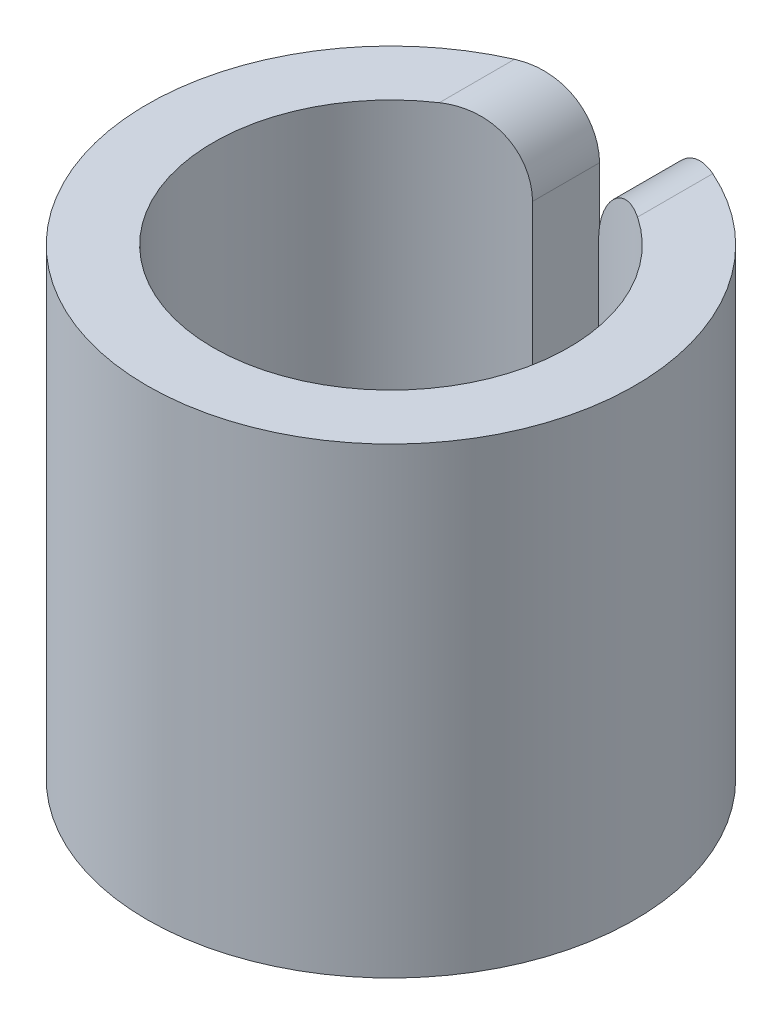
ISO-10303-21;
HEADER;
FILE_DESCRIPTION(('STEP AP214'),'2;1');
FILE_NAME('part.step','',(''),(''),'','','');
FILE_SCHEMA(('AUTOMOTIVE_DESIGN { 1 0 10303 214 1 1 1 1 }'));
ENDSEC;
DATA;
#1=APPLICATION_CONTEXT('core data for automotive mechanical design processes');
#2=APPLICATION_PROTOCOL_DEFINITION('international standard','automotive_design',2000,#1);
#3=PRODUCT_CONTEXT('',#1,'mechanical');
#4=PRODUCT('Part','Part','',(#3));
#5=PRODUCT_RELATED_PRODUCT_CATEGORY('part','',(#4));
#6=PRODUCT_DEFINITION_FORMATION('','',#4);
#7=PRODUCT_DEFINITION_CONTEXT('part definition',#1,'design');
#8=PRODUCT_DEFINITION('design','',#6,#7);
#9=PRODUCT_DEFINITION_SHAPE('','',#8);
#10=(LENGTH_UNIT() NAMED_UNIT(*) SI_UNIT(.MILLI.,.METRE.));
#11=(NAMED_UNIT(*) PLANE_ANGLE_UNIT() SI_UNIT($,.RADIAN.));
#12=(NAMED_UNIT(*) SI_UNIT($,.STERADIAN.) SOLID_ANGLE_UNIT());
#13=UNCERTAINTY_MEASURE_WITH_UNIT(LENGTH_MEASURE(1.E-05),#10,'distance_accuracy_value','');
#14=(GEOMETRIC_REPRESENTATION_CONTEXT(3) GLOBAL_UNCERTAINTY_ASSIGNED_CONTEXT((#13)) GLOBAL_UNIT_ASSIGNED_CONTEXT((#10,
#11,#12)) REPRESENTATION_CONTEXT('',''));
#15=CARTESIAN_POINT('',(0.,0.,0.));
#16=DIRECTION('',(0.,0.,1.));
#17=DIRECTION('',(1.,0.,0.));
#18=AXIS2_PLACEMENT_3D('',#15,#16,#17);
#19=CARTESIAN_POINT('',(0.,3.5,0.));
#20=DIRECTION('',(0.,1.,0.));
#21=DIRECTION('',(0.,0.,1.));
#22=AXIS2_PLACEMENT_3D('',#19,#20,#21);
#23=PLANE('',#22);
#24=CARTESIAN_POINT('',(0.,3.5,0.));
#25=DIRECTION('',(0.,1.,0.));
#26=DIRECTION('',(1.,0.,0.));
#27=AXIS2_PLACEMENT_3D('',#24,#25,#26);
#28=CIRCLE('',#27,3.69);
#29=CARTESIAN_POINT('',(-1.50000000000031,3.5,-3.37136470883811));
#30=VERTEX_POINT('',#29);
#31=CARTESIAN_POINT('',(1.5000000000003,3.5,-3.37136470883811));
#32=VERTEX_POINT('',#31);
#33=EDGE_CURVE('E228',#30,#32,#28,.T.);
#34=ORIENTED_EDGE('',*,*,#33,.T.);
#35=DIRECTION('',(0.,0.,-1.));
#36=VECTOR('',#35,1.);
#37=CARTESIAN_POINT('',(1.5000000000003,3.5,-2.64312315263586));
#38=LINE('',#37,#36);
#39=CARTESIAN_POINT('',(1.5000000000003,3.5,-2.23295767984955));
#40=VERTEX_POINT('',#39);
#41=EDGE_CURVE('E138',#32,#40,#38,.F.);
#42=ORIENTED_EDGE('',*,*,#41,.T.);
#43=CARTESIAN_POINT('',(0.,3.5,0.));
#44=DIRECTION('',(0.,1.,0.));
#45=DIRECTION('',(0.,0.,1.));
#46=AXIS2_PLACEMENT_3D('',#43,#44,#45);
#47=CIRCLE('',#46,2.69);
#48=CARTESIAN_POINT('',(-1.50000000000031,3.5,-2.23295767984955));
#49=VERTEX_POINT('',#48);
#50=EDGE_CURVE('E232',#49,#40,#47,.T.);
#51=ORIENTED_EDGE('',*,*,#50,.F.);
#52=DIRECTION('',(0.,0.,1.));
#53=VECTOR('',#52,1.);
#54=CARTESIAN_POINT('',(-1.50000000000031,3.5,-3.65596772414633));
#55=LINE('',#54,#53);
#56=EDGE_CURVE('E144',#49,#30,#55,.F.);
#57=ORIENTED_EDGE('',*,*,#56,.T.);
#58=EDGE_LOOP('',(#34,#42,#51,#57));
#59=FACE_BOUND('',#58,.T.);
#60=ADVANCED_FACE('F43',(#59),#23,.T.);
#61=CARTESIAN_POINT('',(0.,-3.5,0.));
#62=DIRECTION('',(0.,1.,0.));
#63=DIRECTION('',(0.,0.,1.));
#64=AXIS2_PLACEMENT_3D('',#61,#62,#63);
#65=PLANE('',#64);
#66=CARTESIAN_POINT('',(0.,-3.5,0.));
#67=DIRECTION('',(0.,1.,0.));
#68=DIRECTION('',(1.,0.,0.));
#69=AXIS2_PLACEMENT_3D('',#66,#67,#68);
#70=CIRCLE('',#69,3.69);
#71=CARTESIAN_POINT('',(-1.50000000000031,-3.5,-3.37136470883811));
#72=VERTEX_POINT('',#71);
#73=CARTESIAN_POINT('',(1.5000000000003,-3.5,-3.37136470883811));
#74=VERTEX_POINT('',#73);
#75=EDGE_CURVE('E229',#72,#74,#70,.T.);
#76=ORIENTED_EDGE('',*,*,#75,.F.);
#77=DIRECTION('',(0.,0.,1.));
#78=VECTOR('',#77,1.);
#79=CARTESIAN_POINT('',(-1.50000000000031,-3.5,0.));
#80=LINE('',#79,#78);
#81=CARTESIAN_POINT('',(-1.50000000000031,-3.5,-2.23295767984955));
#82=VERTEX_POINT('',#81);
#83=EDGE_CURVE('E12',#72,#82,#80,.T.);
#84=ORIENTED_EDGE('',*,*,#83,.T.);
#85=CARTESIAN_POINT('',(0.,-3.5,0.));
#86=DIRECTION('',(0.,1.,0.));
#87=DIRECTION('',(0.,0.,1.));
#88=AXIS2_PLACEMENT_3D('',#85,#86,#87);
#89=CIRCLE('',#88,2.69);
#90=CARTESIAN_POINT('',(1.5000000000003,-3.5,-2.23295767984955));
#91=VERTEX_POINT('',#90);
#92=EDGE_CURVE('E236',#82,#91,#89,.T.);
#93=ORIENTED_EDGE('',*,*,#92,.T.);
#94=DIRECTION('',(0.,0.,-1.));
#95=VECTOR('',#94,1.);
#96=CARTESIAN_POINT('',(1.50000000000031,-3.5,0.));
#97=LINE('',#96,#95);
#98=EDGE_CURVE('E53',#91,#74,#97,.T.);
#99=ORIENTED_EDGE('',*,*,#98,.T.);
#100=EDGE_LOOP('',(#76,#84,#93,#99));
#101=FACE_BOUND('',#100,.T.);
#102=ADVANCED_FACE('F212',(#101),#65,.F.);
#103=CARTESIAN_POINT('',(0.,3.5,0.));
#104=DIRECTION('',(0.,-1.,0.));
#105=DIRECTION('',(0.,0.,-1.));
#106=AXIS2_PLACEMENT_3D('',#103,#104,#105);
#107=CYLINDRICAL_SURFACE('',#106,3.69);
#108=DIRECTION('',(0.,-1.,0.));
#109=VECTOR('',#108,1.);
#110=CARTESIAN_POINT('',(0.500000000000304,3.5,-3.65596772414633));
#111=LINE('',#110,#109);
#112=CARTESIAN_POINT('',(0.500000000000304,-2.5,-3.65596772414633));
#113=VERTEX_POINT('',#112);
#114=CARTESIAN_POINT('',(0.500000000000304,2.5,-3.65596772414633));
#115=VERTEX_POINT('',#114);
#116=EDGE_CURVE('E120',#113,#115,#111,.F.);
#117=ORIENTED_EDGE('',*,*,#116,.T.);
#118=CARTESIAN_POINT('',(0.500000000000304,2.5,-3.65596772414633));
#119=CARTESIAN_POINT('',(0.500000082817128,2.52781308003016,-3.65596589444756));
#120=CARTESIAN_POINT('',(0.501161105023619,2.55561289754367,-3.65580913444034));
#121=CARTESIAN_POINT('',(0.505792187211567,2.6110148931079,-3.65517199456636));
#122=CARTESIAN_POINT('',(0.50926217660817,2.63861707717418,-3.65469162459231));
#123=CARTESIAN_POINT('',(0.523102806023595,2.72079211858252,-3.65274636491329));
#124=CARTESIAN_POINT('',(0.536904193141292,2.77481659287134,-3.65077739985674));
#125=CARTESIAN_POINT('',(0.573247241827748,2.87976144457652,-3.64524643417263));
#126=CARTESIAN_POINT('',(0.595794067371662,2.93067996740592,-3.64168349214823));
#127=CARTESIAN_POINT('',(0.648916993247099,3.02794443270229,-3.63259271768315));
#128=CARTESIAN_POINT('',(0.679491276005795,3.07429140699323,-3.62706532993124));
#129=CARTESIAN_POINT('',(0.747538941507797,3.16092764397699,-3.61365181736284));
#130=CARTESIAN_POINT('',(0.784985584494407,3.20123932206504,-3.6057747630603));
#131=CARTESIAN_POINT('',(0.86558425601745,3.27491725667402,-3.58727877515535));
#132=CARTESIAN_POINT('',(0.908735294516107,3.30828471583168,-3.5766603170387));
#133=CARTESIAN_POINT('',(0.999193522604081,3.36723924266644,-3.55244956037333));
#134=CARTESIAN_POINT('',(1.04649411359834,3.39283838441752,-3.53886193385552));
#135=CARTESIAN_POINT('',(1.14377324755107,3.43591339166262,-3.50862903091158));
#136=CARTESIAN_POINT('',(1.1937533511762,3.45338446440442,-3.49198195851895));
#137=CARTESIAN_POINT('',(1.28669550289056,3.47797157474241,-3.45869061170086));
#138=CARTESIAN_POINT('',(1.3294987111058,3.48629834377232,-3.44247338148098));
#139=CARTESIAN_POINT('',(1.41499714517253,3.4973139193632,-3.40823040303336));
#140=CARTESIAN_POINT('',(1.45769239463773,3.50001554219229,-3.39020886421097));
#141=CARTESIAN_POINT('',(1.5000000000003,3.5,-3.37136470883811));
#142=B_SPLINE_CURVE_WITH_KNOTS('',3,(#118,#119,#120,#121,#122,#123,#124,#125,#126,#127,#128,
#129,#130,#131,#132,#133,#134,#135,#136,#137,#138,#139,#140,#141),.UNSPECIFIED.,.F.,.F.,(4,2,2,
2,2,2,2,2,2,2,2,4),(0.,0.0833881928345898,0.166773836619071,0.33329890321556,0.499922448993869,
0.666508300438434,0.832459217659524,0.998381370658126,1.16404429891574,1.32980478763568,
1.46900232215449,1.60788236202148),.UNSPECIFIED.);
#143=EDGE_CURVE('E199',#115,#32,#142,.T.);
#144=ORIENTED_EDGE('',*,*,#143,.T.);
#145=ORIENTED_EDGE('',*,*,#33,.F.);
#146=CARTESIAN_POINT('',(-1.50000000000031,3.5,-3.37136470883811));
#147=CARTESIAN_POINT('',(-1.47283124298569,3.49999911402014,-3.38345442984184));
#148=CARTESIAN_POINT('',(-1.44552337566981,3.49889177376586,-3.39520865002755));
#149=CARTESIAN_POINT('',(-1.39078220506359,3.49439800416099,-3.41799695761536));
#150=CARTESIAN_POINT('',(-1.36334885324912,3.49101060313515,-3.42903073579233));
#151=CARTESIAN_POINT('',(-1.28108333169826,3.47732339670899,-3.4609787511372));
#152=CARTESIAN_POINT('',(-1.22632751721839,3.46349838659932,-3.48072111622429));
#153=CARTESIAN_POINT('',(-1.11880038559413,3.42624830983785,-3.51676237348628));
#154=CARTESIAN_POINT('',(-1.06603529477733,3.40279547467992,-3.53305109688307));
#155=CARTESIAN_POINT('',(-0.964681452839087,3.34663014332049,-3.56205915549299));
#156=CARTESIAN_POINT('',(-0.91608709375197,3.31393034314585,-3.57478333744522));
#157=CARTESIAN_POINT('',(-0.827434063685409,3.24211299988178,-3.59630721396851));
#158=CARTESIAN_POINT('',(-0.787054004133002,3.20344399168274,-3.60528341577583));
#159=CARTESIAN_POINT('',(-0.713091469623131,3.11959659706418,-3.62063960903582));
#160=CARTESIAN_POINT('',(-0.679511640998017,3.0744156881796,-3.62701859074379));
#161=CARTESIAN_POINT('',(-0.620941115192489,2.97988048549831,-3.63749948407966));
#162=CARTESIAN_POINT('',(-0.595786449806398,2.93063241244919,-3.64164595484003));
#163=CARTESIAN_POINT('',(-0.553917903150092,2.82858167000932,-3.64824978499721));
#164=CARTESIAN_POINT('',(-0.537198866652182,2.77578119399971,-3.65070817635475));
#165=CARTESIAN_POINT('',(-0.516660421431358,2.68557832345602,-3.6536601325258));
#166=CARTESIAN_POINT('',(-0.510417633291857,2.64872065017259,-3.65453204876113));
#167=CARTESIAN_POINT('',(-0.502087280502385,2.57458021975313,-3.65568230067327));
#168=CARTESIAN_POINT('',(-0.499994096884805,2.53729810629023,-3.65596143906539));
#169=CARTESIAN_POINT('',(-0.500000000000306,2.5,-3.65596772414633));
#170=B_SPLINE_CURVE_WITH_KNOTS('',3,(#146,#147,#148,#149,#150,#151,#152,#153,#154,#155,#156,
#157,#158,#159,#160,#161,#162,#163,#164,#165,#166,#167,#168,#169),.UNSPECIFIED.,.F.,.F.,(4,2,2,
2,2,2,2,2,2,2,2,4),(0.,0.0891673504576794,0.178372724729981,0.356919087446533,0.535984071296006,
0.714804383854775,0.883849602199933,1.05296047916786,1.21855755873119,1.38405331475116,
1.49600844207335,1.60781186744674),.UNSPECIFIED.);
#171=CARTESIAN_POINT('',(-0.500000000000306,2.5,-3.65596772414633));
#172=VERTEX_POINT('',#171);
#173=EDGE_CURVE('E191',#30,#172,#170,.T.);
#174=ORIENTED_EDGE('',*,*,#173,.T.);
#175=DIRECTION('',(0.,-1.,0.));
#176=VECTOR('',#175,1.);
#177=CARTESIAN_POINT('',(-0.500000000000306,3.5,-3.65596772414633));
#178=LINE('',#177,#176);
#179=CARTESIAN_POINT('',(-0.500000000000306,-2.5,-3.65596772414633));
#180=VERTEX_POINT('',#179);
#181=EDGE_CURVE('E243',#172,#180,#178,.T.);
#182=ORIENTED_EDGE('',*,*,#181,.T.);
#183=CARTESIAN_POINT('',(-0.500000000000306,-2.5,-3.65596772414633));
#184=CARTESIAN_POINT('',(-0.50000008281713,-2.52781308003016,-3.65596589444755));
#185=CARTESIAN_POINT('',(-0.501161105023621,-2.55561289754367,-3.65580913444034));
#186=CARTESIAN_POINT('',(-0.505792187211569,-2.6110148931079,-3.65517199456636));
#187=CARTESIAN_POINT('',(-0.509262176608172,-2.63861707717418,-3.6546916245923));
#188=CARTESIAN_POINT('',(-0.523102806023597,-2.72079211858252,-3.65274636491329));
#189=CARTESIAN_POINT('',(-0.536904193141294,-2.77481659287134,-3.65077739985674));
#190=CARTESIAN_POINT('',(-0.57324724182775,-2.87976144457652,-3.64524643417262));
#191=CARTESIAN_POINT('',(-0.595794067371664,-2.93067996740592,-3.64168349214823));
#192=CARTESIAN_POINT('',(-0.648916993247101,-3.02794443270229,-3.63259271768315));
#193=CARTESIAN_POINT('',(-0.679491276005797,-3.07429140699323,-3.62706532993124));
#194=CARTESIAN_POINT('',(-0.747538941507798,-3.16092764397699,-3.61365181736284));
#195=CARTESIAN_POINT('',(-0.78498558449441,-3.20123932206504,-3.6057747630603));
#196=CARTESIAN_POINT('',(-0.865584256017452,-3.27491725667402,-3.58727877515535));
#197=CARTESIAN_POINT('',(-0.908735294516109,-3.30828471583168,-3.5766603170387));
#198=CARTESIAN_POINT('',(-0.999193522604083,-3.36723924266644,-3.55244956037333));
#199=CARTESIAN_POINT('',(-1.04649411359834,-3.39283838441752,-3.53886193385552));
#200=CARTESIAN_POINT('',(-1.14377324755107,-3.43591339166262,-3.50862903091158));
#201=CARTESIAN_POINT('',(-1.19375335117621,-3.45338446440442,-3.49198195851895));
#202=CARTESIAN_POINT('',(-1.28669550289056,-3.47797157474241,-3.45869061170086));
#203=CARTESIAN_POINT('',(-1.3294987111058,-3.48629834377232,-3.44247338148098));
#204=CARTESIAN_POINT('',(-1.41499714517254,-3.4973139193632,-3.40823040303336));
#205=CARTESIAN_POINT('',(-1.45769239463774,-3.50001554219229,-3.39020886421097));
#206=CARTESIAN_POINT('',(-1.50000000000031,-3.5,-3.37136470883811));
#207=B_SPLINE_CURVE_WITH_KNOTS('',3,(#183,#184,#185,#186,#187,#188,#189,#190,#191,#192,#193,
#194,#195,#196,#197,#198,#199,#200,#201,#202,#203,#204,#205,#206),.UNSPECIFIED.,.F.,.F.,(4,2,2,
2,2,2,2,2,2,2,2,4),(0.,0.0833881928345898,0.166773836619071,0.33329890321556,0.499922448993869,
0.666508300438434,0.832459217659524,0.998381370658126,1.16404429891574,1.32980478763568,
1.46900232215449,1.60788236202148),.UNSPECIFIED.);
#208=EDGE_CURVE('E200',#180,#72,#207,.T.);
#209=ORIENTED_EDGE('',*,*,#208,.T.);
#210=ORIENTED_EDGE('',*,*,#75,.T.);
#211=CARTESIAN_POINT('',(1.5000000000003,-3.5,-3.37136470883811));
#212=CARTESIAN_POINT('',(1.47283124298569,-3.49999911402014,-3.38345442984184));
#213=CARTESIAN_POINT('',(1.4455233756698,-3.49889177376586,-3.39520865002755));
#214=CARTESIAN_POINT('',(1.39078220506359,-3.49439800416099,-3.41799695761536));
#215=CARTESIAN_POINT('',(1.36334885324912,-3.49101060313515,-3.42903073579233));
#216=CARTESIAN_POINT('',(1.28108333169826,-3.47732339670899,-3.4609787511372));
#217=CARTESIAN_POINT('',(1.22632751721839,-3.46349838659932,-3.48072111622429));
#218=CARTESIAN_POINT('',(1.11880038559413,-3.42624830983785,-3.51676237348628));
#219=CARTESIAN_POINT('',(1.06603529477733,-3.40279547467992,-3.53305109688307));
#220=CARTESIAN_POINT('',(0.964681452839084,-3.34663014332049,-3.56205915549299));
#221=CARTESIAN_POINT('',(0.916087093751967,-3.31393034314585,-3.57478333744522));
#222=CARTESIAN_POINT('',(0.827434063685406,-3.24211299988178,-3.59630721396851));
#223=CARTESIAN_POINT('',(0.787054004133,-3.20344399168274,-3.60528341577583));
#224=CARTESIAN_POINT('',(0.713091469623128,-3.11959659706418,-3.62063960903582));
#225=CARTESIAN_POINT('',(0.679511640998014,-3.0744156881796,-3.62701859074379));
#226=CARTESIAN_POINT('',(0.620941115192486,-2.97988048549831,-3.63749948407966));
#227=CARTESIAN_POINT('',(0.595786449806395,-2.93063241244919,-3.64164595484003));
#228=CARTESIAN_POINT('',(0.55391790315009,-2.82858167000932,-3.64824978499722));
#229=CARTESIAN_POINT('',(0.53719886665218,-2.77578119399971,-3.65070817635475));
#230=CARTESIAN_POINT('',(0.516660421431356,-2.68557832345602,-3.6536601325258));
#231=CARTESIAN_POINT('',(0.510417633291854,-2.64872065017259,-3.65453204876113));
#232=CARTESIAN_POINT('',(0.502087280502383,-2.57458021975313,-3.65568230067327));
#233=CARTESIAN_POINT('',(0.499994096884802,-2.53729810629023,-3.65596143906539));
#234=CARTESIAN_POINT('',(0.500000000000304,-2.5,-3.65596772414633));
#235=B_SPLINE_CURVE_WITH_KNOTS('',3,(#211,#212,#213,#214,#215,#216,#217,#218,#219,#220,#221,
#222,#223,#224,#225,#226,#227,#228,#229,#230,#231,#232,#233,#234),.UNSPECIFIED.,.F.,.F.,(4,2,2,
2,2,2,2,2,2,2,2,4),(0.,0.0891673504576795,0.178372724729981,0.356919087446533,0.535984071296007,
0.714804383854775,0.883849602199935,1.05296047916786,1.21855755873119,1.38405331475116,
1.49600844207335,1.60781186744674),.UNSPECIFIED.);
#236=EDGE_CURVE('E216',#74,#113,#235,.T.);
#237=ORIENTED_EDGE('',*,*,#236,.T.);
#238=EDGE_LOOP('',(#117,#144,#145,#174,#182,#209,#210,#237));
#239=FACE_BOUND('',#238,.T.);
#240=ADVANCED_FACE('F162',(#239),#107,.T.);
#241=CARTESIAN_POINT('',(0.,3.5,0.));
#242=DIRECTION('',(0.,-1.,0.));
#243=DIRECTION('',(0.,0.,-1.));
#244=AXIS2_PLACEMENT_3D('',#241,#242,#243);
#245=CYLINDRICAL_SURFACE('',#244,2.69);
#246=ORIENTED_EDGE('',*,*,#50,.T.);
#247=CARTESIAN_POINT('',(1.5000000000003,3.5,-2.23295767984955));
#248=CARTESIAN_POINT('',(1.47393017245271,3.49999837185871,-2.25047229639951));
#249=CARTESIAN_POINT('',(1.4475565465579,3.49897936173474,-2.26752320903815));
#250=CARTESIAN_POINT('',(1.39433612973415,3.4947613634631,-2.30063243814991));
#251=CARTESIAN_POINT('',(1.36748896798295,3.49156058557811,-2.3166899278983));
#252=CARTESIAN_POINT('',(1.28633140054199,3.47844179563074,-2.36333159237758));
#253=CARTESIAN_POINT('',(1.23157410673629,3.46500543581051,-2.39227159524748));
#254=CARTESIAN_POINT('',(1.12275052799407,3.42790328059018,-2.44524384814602));
#255=CARTESIAN_POINT('',(1.06868931956647,3.40418463442944,-2.46924978447332));
#256=CARTESIAN_POINT('',(0.964210189226732,3.34644859446251,-2.51188659256823));
#257=CARTESIAN_POINT('',(0.913782941373829,3.31245881694278,-2.53053161922726));
#258=CARTESIAN_POINT('',(0.82408567349399,3.23901307178568,-2.56105340380737));
#259=CARTESIAN_POINT('',(0.784199692633862,3.20051565216095,-2.5734374843676));
#260=CARTESIAN_POINT('',(0.710953024800094,3.11684331726017,-2.59462969362012));
#261=CARTESIAN_POINT('',(0.67759622370264,3.07166445339456,-2.60343569613371));
#262=CARTESIAN_POINT('',(0.619928883414566,2.97789917424908,-2.61775475010274));
#263=CARTESIAN_POINT('',(0.59531424605856,2.9295165616392,-2.62338365396008));
#264=CARTESIAN_POINT('',(0.554202842875677,2.82924097563509,-2.63237608746749));
#265=CARTESIAN_POINT('',(0.537700860243294,2.7773502825837,-2.63574107343407));
#266=CARTESIAN_POINT('',(0.517043639393555,2.68767927175128,-2.63985630262082));
#267=CARTESIAN_POINT('',(0.510658370327382,2.65041759420553,-2.6410908595129));
#268=CARTESIAN_POINT('',(0.502135689193274,2.57544197441234,-2.64271915118247));
#269=CARTESIAN_POINT('',(0.499992832678376,2.53772867439844,-2.64311396368385));
#270=CARTESIAN_POINT('',(0.500000000000305,2.5,-2.64312315263585));
#271=B_SPLINE_CURVE_WITH_KNOTS('',3,(#247,#248,#249,#250,#251,#252,#253,#254,#255,#256,#257,
#258,#259,#260,#261,#262,#263,#264,#265,#266,#267,#268,#269,#270),.UNSPECIFIED.,.F.,.F.,(4,2,2,
2,2,2,2,2,2,2,2,4),(0.,0.0941813046709036,0.188439960824099,0.377561292895441,0.56766644979601,
0.757264946022282,0.926807579701084,1.09645081280762,1.25942444404575,1.4222931383074,
1.53553173147533,1.64862490686934),.UNSPECIFIED.);
#272=CARTESIAN_POINT('',(0.500000000000305,2.5,-2.64312315263585));
#273=VERTEX_POINT('',#272);
#274=EDGE_CURVE('E131',#40,#273,#271,.T.);
#275=ORIENTED_EDGE('',*,*,#274,.T.);
#276=DIRECTION('',(0.,-1.,0.));
#277=VECTOR('',#276,1.);
#278=CARTESIAN_POINT('',(0.500000000000305,3.5,-2.64312315263585));
#279=LINE('',#278,#277);
#280=CARTESIAN_POINT('',(0.500000000000305,-2.5,-2.64312315263585));
#281=VERTEX_POINT('',#280);
#282=EDGE_CURVE('E117',#281,#273,#279,.F.);
#283=ORIENTED_EDGE('',*,*,#282,.F.);
#284=CARTESIAN_POINT('',(0.500000000000305,-2.5,-2.64312315263585));
#285=CARTESIAN_POINT('',(0.499999995122989,-2.52752641471898,-2.64312070240151));
#286=CARTESIAN_POINT('',(0.501137315505936,-2.55503975914015,-2.64290828647739));
#287=CARTESIAN_POINT('',(0.505673252206333,-2.60987199602344,-2.64204511749369));
#288=CARTESIAN_POINT('',(0.509071833771749,-2.63719089146742,-2.64139437117056));
#289=CARTESIAN_POINT('',(0.522627557385167,-2.71853310444462,-2.63875933930659));
#290=CARTESIAN_POINT('',(0.536144756550798,-2.77201547033434,-2.63609234996875));
#291=CARTESIAN_POINT('',(0.571717509342946,-2.87591570021494,-2.62860528565428));
#292=CARTESIAN_POINT('',(0.593778947363309,-2.92633142447055,-2.62378372647858));
#293=CARTESIAN_POINT('',(0.645686230417958,-3.0226243918863,-2.61149335069047));
#294=CARTESIAN_POINT('',(0.675529935680731,-3.06850287780671,-2.6040252615518));
#295=CARTESIAN_POINT('',(0.74167779153173,-3.15410448595645,-2.5859576266356));
#296=CARTESIAN_POINT('',(0.777934574194954,-3.19386899400994,-2.57538068800575));
#297=CARTESIAN_POINT('',(0.855643284040086,-3.26657290192919,-2.55061418013613));
#298=CARTESIAN_POINT('',(0.89709283965185,-3.29951539934186,-2.53642625702236));
#299=CARTESIAN_POINT('',(0.983405901407139,-3.35780682869802,-2.50422097778695));
#300=CARTESIAN_POINT('',(1.02825539791942,-3.38318500161982,-2.4862188405357));
#301=CARTESIAN_POINT('',(1.11990018020859,-3.4263345739998,-2.44630866779017));
#302=CARTESIAN_POINT('',(1.16669830285675,-3.44409442515997,-2.4243947733282));
#303=CARTESIAN_POINT('',(1.26199229227113,-3.47257129877969,-2.3762160231098));
#304=CARTESIAN_POINT('',(1.31049854302437,-3.48307325874132,-2.34984499669727));
#305=CARTESIAN_POINT('',(1.38240270501298,-3.49335673795523,-2.30777751860136));
#306=CARTESIAN_POINT('',(1.40620225712125,-3.4958732166041,-2.29335394797589));
#307=CARTESIAN_POINT('',(1.45341420943893,-3.49919381627999,-2.26372775684788));
#308=CARTESIAN_POINT('',(1.47682683503502,-3.49999897174706,-2.24852561266321));
#309=CARTESIAN_POINT('',(1.50000000000031,-3.5,-2.23295767984955));
#310=B_SPLINE_CURVE_WITH_KNOTS('',3,(#284,#285,#286,#287,#288,#289,#290,#291,#292,#293,#294,
#295,#296,#297,#298,#299,#300,#301,#302,#303,#304,#305,#306,#307,#308,#309),.UNSPECIFIED.,.F.,
.F.,(4,2,2,2,2,2,2,2,2,2,2,2,4),(0.,0.0825289068692493,0.165056545428112,0.329894044555414,
0.494845269267519,0.659751187587478,0.823486409420319,0.987147123167073,1.15016672400751,
1.31343257366946,1.48134980638683,1.56512250073506,1.64884454275528),.UNSPECIFIED.);
#311=EDGE_CURVE('E128',#281,#91,#310,.T.);
#312=ORIENTED_EDGE('',*,*,#311,.T.);
#313=ORIENTED_EDGE('',*,*,#92,.F.);
#314=CARTESIAN_POINT('',(-1.50000000000031,-3.5,-2.23295767984955));
#315=CARTESIAN_POINT('',(-1.47393017245271,-3.49999837185871,-2.25047229639951));
#316=CARTESIAN_POINT('',(-1.44755654655791,-3.49897936173474,-2.26752320903815));
#317=CARTESIAN_POINT('',(-1.39433612973416,-3.4947613634631,-2.30063243814991));
#318=CARTESIAN_POINT('',(-1.36748896798295,-3.49156058557811,-2.3166899278983));
#319=CARTESIAN_POINT('',(-1.286331400542,-3.47844179563074,-2.36333159237758));
#320=CARTESIAN_POINT('',(-1.23157410673629,-3.46500543581051,-2.39227159524748));
#321=CARTESIAN_POINT('',(-1.12275052799407,-3.42790328059018,-2.44524384814602));
#322=CARTESIAN_POINT('',(-1.06868931956647,-3.40418463442944,-2.46924978447332));
#323=CARTESIAN_POINT('',(-0.964210189226734,-3.34644859446251,-2.51188659256823));
#324=CARTESIAN_POINT('',(-0.91378294137383,-3.31245881694278,-2.53053161922726));
#325=CARTESIAN_POINT('',(-0.824085673493992,-3.23901307178568,-2.56105340380737));
#326=CARTESIAN_POINT('',(-0.784199692633864,-3.20051565216095,-2.5734374843676));
#327=CARTESIAN_POINT('',(-0.710953024800095,-3.11684331726017,-2.59462969362012));
#328=CARTESIAN_POINT('',(-0.677596223702641,-3.07166445339456,-2.60343569613371));
#329=CARTESIAN_POINT('',(-0.619928883414567,-2.97789917424908,-2.61775475010274));
#330=CARTESIAN_POINT('',(-0.595314246058561,-2.9295165616392,-2.62338365396008));
#331=CARTESIAN_POINT('',(-0.554202842875679,-2.82924097563509,-2.63237608746749));
#332=CARTESIAN_POINT('',(-0.537700860243296,-2.7773502825837,-2.63574107343407));
#333=CARTESIAN_POINT('',(-0.517043639393557,-2.68767927175128,-2.63985630262082));
#334=CARTESIAN_POINT('',(-0.510658370327383,-2.65041759420553,-2.6410908595129));
#335=CARTESIAN_POINT('',(-0.502135689193276,-2.57544197441234,-2.64271915118247));
#336=CARTESIAN_POINT('',(-0.499992832678377,-2.53772867439844,-2.64311396368385));
#337=CARTESIAN_POINT('',(-0.500000000000306,-2.5,-2.64312315263585));
#338=B_SPLINE_CURVE_WITH_KNOTS('',3,(#314,#315,#316,#317,#318,#319,#320,#321,#322,#323,#324,
#325,#326,#327,#328,#329,#330,#331,#332,#333,#334,#335,#336,#337),.UNSPECIFIED.,.F.,.F.,(4,2,2,
2,2,2,2,2,2,2,2,4),(0.,0.0941813046709034,0.188439960824099,0.377561292895441,0.56766644979601,
0.757264946022282,0.926807579701084,1.09645081280762,1.25942444404575,1.4222931383074,
1.53553173147533,1.64862490686934),.UNSPECIFIED.);
#339=CARTESIAN_POINT('',(-0.500000000000306,-2.5,-2.64312315263585));
#340=VERTEX_POINT('',#339);
#341=EDGE_CURVE('E60',#82,#340,#338,.T.);
#342=ORIENTED_EDGE('',*,*,#341,.T.);
#343=DIRECTION('',(0.,-1.,0.));
#344=VECTOR('',#343,1.);
#345=CARTESIAN_POINT('',(-0.500000000000306,3.5,-2.64312315263585));
#346=LINE('',#345,#344);
#347=CARTESIAN_POINT('',(-0.500000000000306,2.5,-2.64312315263585));
#348=VERTEX_POINT('',#347);
#349=EDGE_CURVE('E133',#348,#340,#346,.T.);
#350=ORIENTED_EDGE('',*,*,#349,.F.);
#351=CARTESIAN_POINT('',(-0.500000000000306,2.5,-2.64312315263585));
#352=CARTESIAN_POINT('',(-0.49999999512299,2.52752641471898,-2.64312070240151));
#353=CARTESIAN_POINT('',(-0.501137315505937,2.55503975914015,-2.64290828647739));
#354=CARTESIAN_POINT('',(-0.505673252206334,2.60987199602344,-2.64204511749369));
#355=CARTESIAN_POINT('',(-0.509071833771751,2.63719089146742,-2.64139437117056));
#356=CARTESIAN_POINT('',(-0.522627557385169,2.71853310444462,-2.63875933930659));
#357=CARTESIAN_POINT('',(-0.536144756550799,2.77201547033434,-2.63609234996875));
#358=CARTESIAN_POINT('',(-0.571717509342947,2.87591570021494,-2.62860528565428));
#359=CARTESIAN_POINT('',(-0.59377894736331,2.92633142447054,-2.62378372647858));
#360=CARTESIAN_POINT('',(-0.645686230417959,3.0226243918863,-2.61149335069047));
#361=CARTESIAN_POINT('',(-0.675529935680733,3.06850287780671,-2.6040252615518));
#362=CARTESIAN_POINT('',(-0.741677791531732,3.15410448595645,-2.5859576266356));
#363=CARTESIAN_POINT('',(-0.777934574194956,3.19386899400994,-2.57538068800575));
#364=CARTESIAN_POINT('',(-0.855643284040089,3.26657290192919,-2.55061418013613));
#365=CARTESIAN_POINT('',(-0.897092839651852,3.29951539934186,-2.53642625702236));
#366=CARTESIAN_POINT('',(-0.983405901407141,3.35780682869802,-2.50422097778695));
#367=CARTESIAN_POINT('',(-1.02825539791942,3.38318500161982,-2.4862188405357));
#368=CARTESIAN_POINT('',(-1.11990018020859,3.4263345739998,-2.44630866779017));
#369=CARTESIAN_POINT('',(-1.16669830285676,3.44409442515997,-2.4243947733282));
#370=CARTESIAN_POINT('',(-1.26199229227114,3.47257129877969,-2.3762160231098));
#371=CARTESIAN_POINT('',(-1.31049854302438,3.48307325874132,-2.34984499669727));
#372=CARTESIAN_POINT('',(-1.38240270501298,3.49335673795523,-2.30777751860136));
#373=CARTESIAN_POINT('',(-1.40620225712125,3.4958732166041,-2.29335394797589));
#374=CARTESIAN_POINT('',(-1.45341420943893,3.49919381627999,-2.26372775684787));
#375=CARTESIAN_POINT('',(-1.47682683503502,3.49999897174706,-2.24852561266321));
#376=CARTESIAN_POINT('',(-1.50000000000031,3.5,-2.23295767984955));
#377=B_SPLINE_CURVE_WITH_KNOTS('',3,(#351,#352,#353,#354,#355,#356,#357,#358,#359,#360,#361,
#362,#363,#364,#365,#366,#367,#368,#369,#370,#371,#372,#373,#374,#375,#376),.UNSPECIFIED.,.F.,
.F.,(4,2,2,2,2,2,2,2,2,2,2,2,4),(0.,0.0825289068692492,0.165056545428113,0.329894044555415,
0.494845269267518,0.659751187587479,0.82348640942032,0.987147123167074,1.15016672400751,
1.31343257366946,1.48134980638683,1.56512250073506,1.64884454275528),.UNSPECIFIED.);
#378=EDGE_CURVE('E68',#348,#49,#377,.T.);
#379=ORIENTED_EDGE('',*,*,#378,.T.);
#380=EDGE_LOOP('',(#246,#275,#283,#312,#313,#342,#350,#379));
#381=FACE_BOUND('',#380,.T.);
#382=ADVANCED_FACE('F127',(#381),#245,.F.);
#383=CARTESIAN_POINT('',(-0.500000000000306,-3.5,0.));
#384=DIRECTION('',(-1.,0.,0.));
#385=DIRECTION('',(0.,0.,1.));
#386=AXIS2_PLACEMENT_3D('',#383,#384,#385);
#387=PLANE('',#386);
#388=ORIENTED_EDGE('',*,*,#181,.F.);
#389=DIRECTION('',(0.,0.,1.));
#390=VECTOR('',#389,1.);
#391=CARTESIAN_POINT('',(-0.500000000000306,2.5,-2.64312315263585));
#392=LINE('',#391,#390);
#393=EDGE_CURVE('E261',#172,#348,#392,.T.);
#394=ORIENTED_EDGE('',*,*,#393,.T.);
#395=ORIENTED_EDGE('',*,*,#349,.T.);
#396=DIRECTION('',(0.,0.,1.));
#397=VECTOR('',#396,1.);
#398=CARTESIAN_POINT('',(-0.500000000000306,-2.5,0.));
#399=LINE('',#398,#397);
#400=EDGE_CURVE('E257',#340,#180,#399,.F.);
#401=ORIENTED_EDGE('',*,*,#400,.T.);
#402=EDGE_LOOP('',(#388,#394,#395,#401));
#403=FACE_BOUND('',#402,.T.);
#404=ADVANCED_FACE('F161',(#403),#387,.F.);
#405=CARTESIAN_POINT('',(0.500000000000306,-3.5,0.));
#406=DIRECTION('',(1.,0.,0.));
#407=DIRECTION('',(0.,0.,-1.));
#408=AXIS2_PLACEMENT_3D('',#405,#406,#407);
#409=PLANE('',#408);
#410=ORIENTED_EDGE('',*,*,#282,.T.);
#411=DIRECTION('',(0.,0.,-1.));
#412=VECTOR('',#411,1.);
#413=CARTESIAN_POINT('',(0.500000000000304,2.5,-3.65596772414633));
#414=LINE('',#413,#412);
#415=EDGE_CURVE('E124',#273,#115,#414,.T.);
#416=ORIENTED_EDGE('',*,*,#415,.T.);
#417=ORIENTED_EDGE('',*,*,#116,.F.);
#418=DIRECTION('',(0.,0.,-1.));
#419=VECTOR('',#418,1.);
#420=CARTESIAN_POINT('',(0.500000000000306,-2.5,0.));
#421=LINE('',#420,#419);
#422=EDGE_CURVE('E113',#113,#281,#421,.F.);
#423=ORIENTED_EDGE('',*,*,#422,.T.);
#424=EDGE_LOOP('',(#410,#416,#417,#423));
#425=FACE_BOUND('',#424,.T.);
#426=ADVANCED_FACE('F115',(#425),#409,.F.);
#427=CARTESIAN_POINT('',(1.50000000000031,2.5,0.));
#428=DIRECTION('',(0.,0.,1.));
#429=DIRECTION('',(1.,0.,0.));
#430=AXIS2_PLACEMENT_3D('',#427,#428,#429);
#431=CYLINDRICAL_SURFACE('',#430,1.);
#432=ORIENTED_EDGE('',*,*,#274,.F.);
#433=ORIENTED_EDGE('',*,*,#41,.F.);
#434=ORIENTED_EDGE('',*,*,#143,.F.);
#435=ORIENTED_EDGE('',*,*,#415,.F.);
#436=EDGE_LOOP('',(#432,#433,#434,#435));
#437=FACE_BOUND('',#436,.T.);
#438=ADVANCED_FACE('F185',(#437),#431,.T.);
#439=CARTESIAN_POINT('',(-1.50000000000031,2.5,0.));
#440=DIRECTION('',(0.,0.,-1.));
#441=DIRECTION('',(-1.,0.,0.));
#442=AXIS2_PLACEMENT_3D('',#439,#440,#441);
#443=CYLINDRICAL_SURFACE('',#442,1.);
#444=ORIENTED_EDGE('',*,*,#173,.F.);
#445=ORIENTED_EDGE('',*,*,#56,.F.);
#446=ORIENTED_EDGE('',*,*,#378,.F.);
#447=ORIENTED_EDGE('',*,*,#393,.F.);
#448=EDGE_LOOP('',(#444,#445,#446,#447));
#449=FACE_BOUND('',#448,.T.);
#450=ADVANCED_FACE('F181',(#449),#443,.T.);
#451=CARTESIAN_POINT('',(-1.50000000000031,-2.5,0.));
#452=DIRECTION('',(0.,0.,1.));
#453=DIRECTION('',(1.,0.,0.));
#454=AXIS2_PLACEMENT_3D('',#451,#452,#453);
#455=CYLINDRICAL_SURFACE('',#454,1.);
#456=ORIENTED_EDGE('',*,*,#208,.F.);
#457=ORIENTED_EDGE('',*,*,#400,.F.);
#458=ORIENTED_EDGE('',*,*,#341,.F.);
#459=ORIENTED_EDGE('',*,*,#83,.F.);
#460=EDGE_LOOP('',(#456,#457,#458,#459));
#461=FACE_BOUND('',#460,.T.);
#462=ADVANCED_FACE('F184',(#461),#455,.T.);
#463=CARTESIAN_POINT('',(1.50000000000031,-2.5,0.));
#464=DIRECTION('',(0.,0.,-1.));
#465=DIRECTION('',(-1.,0.,0.));
#466=AXIS2_PLACEMENT_3D('',#463,#464,#465);
#467=CYLINDRICAL_SURFACE('',#466,1.);
#468=ORIENTED_EDGE('',*,*,#311,.F.);
#469=ORIENTED_EDGE('',*,*,#422,.F.);
#470=ORIENTED_EDGE('',*,*,#236,.F.);
#471=ORIENTED_EDGE('',*,*,#98,.F.);
#472=EDGE_LOOP('',(#468,#469,#470,#471));
#473=FACE_BOUND('',#472,.T.);
#474=ADVANCED_FACE('F45',(#473),#467,.T.);
#475=CLOSED_SHELL('',(#60,#102,#240,#382,#404,#426,#438,#450,#462,#474));
#476=MANIFOLD_SOLID_BREP('B2',#475);
#477=ADVANCED_BREP_SHAPE_REPRESENTATION('',(#18,#476),#14);
#478=SHAPE_DEFINITION_REPRESENTATION(#9,#477);
ENDSEC;
END-ISO-10303-21;
